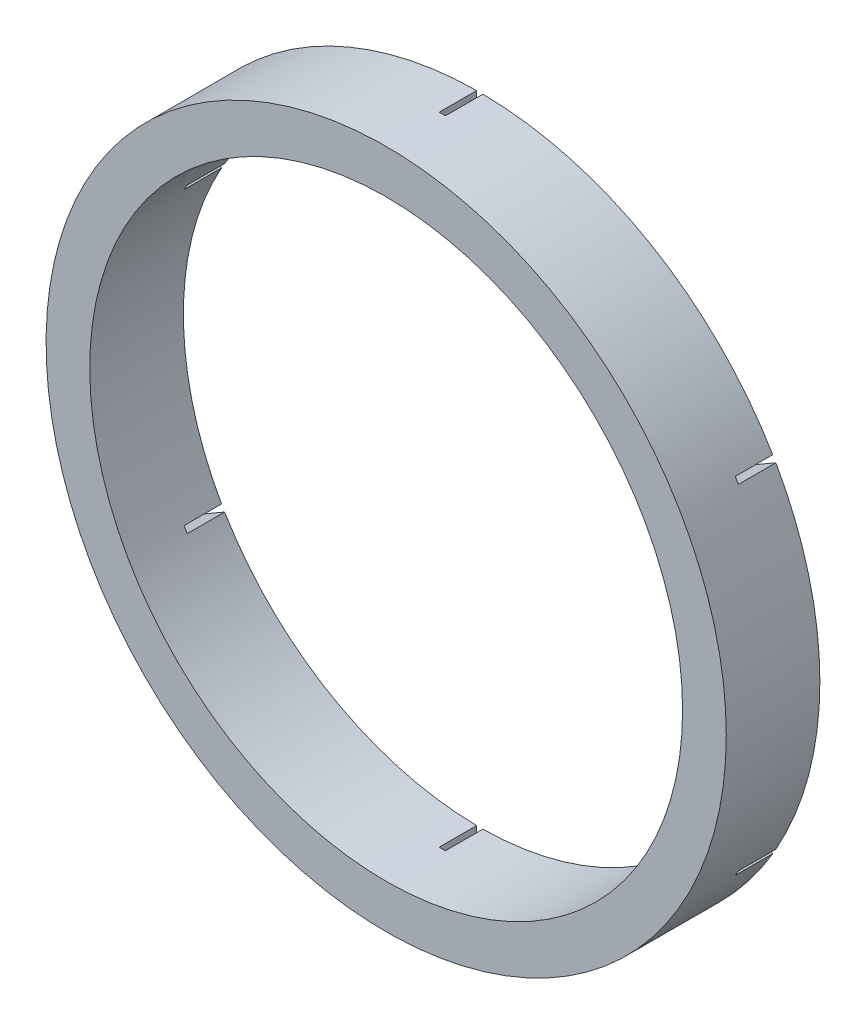
ISO-10303-21;
HEADER;
FILE_DESCRIPTION(('STEP AP214'),'2;1');
FILE_NAME('part.step','',(''),(''),'','','');
FILE_SCHEMA(('AUTOMOTIVE_DESIGN { 1 0 10303 214 1 1 1 1 }'));
ENDSEC;
DATA;
#1=APPLICATION_CONTEXT('core data for automotive mechanical design processes');
#2=APPLICATION_PROTOCOL_DEFINITION('international standard','automotive_design',2000,#1);
#3=PRODUCT_CONTEXT('',#1,'mechanical');
#4=PRODUCT('Part','Part','',(#3));
#5=PRODUCT_RELATED_PRODUCT_CATEGORY('part','',(#4));
#6=PRODUCT_DEFINITION_FORMATION('','',#4);
#7=PRODUCT_DEFINITION_CONTEXT('part definition',#1,'design');
#8=PRODUCT_DEFINITION('design','',#6,#7);
#9=PRODUCT_DEFINITION_SHAPE('','',#8);
#10=(LENGTH_UNIT() NAMED_UNIT(*) SI_UNIT(.MILLI.,.METRE.));
#11=(NAMED_UNIT(*) PLANE_ANGLE_UNIT() SI_UNIT($,.RADIAN.));
#12=(NAMED_UNIT(*) SI_UNIT($,.STERADIAN.) SOLID_ANGLE_UNIT());
#13=UNCERTAINTY_MEASURE_WITH_UNIT(LENGTH_MEASURE(1.E-05),#10,'distance_accuracy_value','');
#14=(GEOMETRIC_REPRESENTATION_CONTEXT(3) GLOBAL_UNCERTAINTY_ASSIGNED_CONTEXT((#13)) GLOBAL_UNIT_ASSIGNED_CONTEXT((#10,
#11,#12)) REPRESENTATION_CONTEXT('',''));
#15=CARTESIAN_POINT('',(0.,0.,0.));
#16=DIRECTION('',(0.,0.,1.));
#17=DIRECTION('',(1.,0.,0.));
#18=AXIS2_PLACEMENT_3D('',#15,#16,#17);
#19=CARTESIAN_POINT('',(0.,0.,0.));
#20=DIRECTION('',(0.,0.,1.));
#21=DIRECTION('',(1.,0.,0.));
#22=AXIS2_PLACEMENT_3D('',#19,#20,#21);
#23=PLANE('',#22);
#24=CARTESIAN_POINT('',(0.,0.,0.));
#25=DIRECTION('',(0.,0.,1.));
#26=DIRECTION('',(1.,0.,0.));
#27=AXIS2_PLACEMENT_3D('',#24,#25,#26);
#28=CIRCLE('',#27,47.5);
#29=CARTESIAN_POINT('',(41.3839276024035,-23.3156714721885,0.));
#30=VERTEX_POINT('',#29);
#31=CARTESIAN_POINT('',(41.3839276024064,23.3156714721833,0.));
#32=VERTEX_POINT('',#31);
#33=EDGE_CURVE('E218',#30,#32,#28,.T.);
#34=ORIENTED_EDGE('',*,*,#33,.T.);
#35=DIRECTION('',(-0.866025403784438,-0.5,0.));
#36=VECTOR('',#35,1.);
#37=CARTESIAN_POINT('',(40.0941241256798,22.5710030876935,0.));
#38=LINE('',#37,#36);
#39=CARTESIAN_POINT('',(47.446398167657,26.8158404849849,0.));
#40=VERTEX_POINT('',#39);
#41=EDGE_CURVE('E209',#40,#32,#38,.T.);
#42=ORIENTED_EDGE('',*,*,#41,.F.);
#43=CARTESIAN_POINT('',(0.,0.,0.));
#44=DIRECTION('',(0.,0.,1.));
#45=DIRECTION('',(1.,0.,0.));
#46=AXIS2_PLACEMENT_3D('',#43,#44,#45);
#47=CIRCLE('',#46,54.5);
#48=CARTESIAN_POINT('',(47.4463981676541,-26.8158404849901,0.));
#49=VERTEX_POINT('',#48);
#50=EDGE_CURVE('E562',#49,#40,#47,.T.);
#51=ORIENTED_EDGE('',*,*,#50,.F.);
#52=DIRECTION('',(0.866025403784438,-0.500000000000001,0.));
#53=VECTOR('',#52,1.);
#54=CARTESIAN_POINT('',(48.9659768137011,-27.6931696253401,0.));
#55=LINE('',#54,#53);
#56=EDGE_CURVE('E561',#30,#49,#55,.T.);
#57=ORIENTED_EDGE('',*,*,#56,.F.);
#58=EDGE_LOOP('',(#34,#42,#51,#57));
#59=FACE_BOUND('',#58,.T.);
#60=ADVANCED_FACE('F32',(#59),#23,.F.);
#61=CARTESIAN_POINT('',(0.499999999991934,-47.4973683481518,0.));
#62=VERTEX_POINT('',#61);
#63=CARTESIAN_POINT('',(40.8839276024034,-24.1816968759729,0.));
#64=VERTEX_POINT('',#63);
#65=EDGE_CURVE('E223',#62,#64,#28,.T.);
#66=ORIENTED_EDGE('',*,*,#65,.T.);
#67=DIRECTION('',(-0.866025403784439,0.5,0.));
#68=VECTOR('',#67,1.);
#69=CARTESIAN_POINT('',(39.594124125677,-23.4370284914831,0.));
#70=LINE('',#69,#68);
#71=CARTESIAN_POINT('',(46.946398167654,-27.6818658887744,0.));
#72=VERTEX_POINT('',#71);
#73=EDGE_CURVE('E255',#72,#64,#70,.T.);
#74=ORIENTED_EDGE('',*,*,#73,.F.);
#75=CARTESIAN_POINT('',(0.49999999999193,-54.4977063737549,0.));
#76=VERTEX_POINT('',#75);
#77=EDGE_CURVE('E658',#76,#72,#47,.T.);
#78=ORIENTED_EDGE('',*,*,#77,.F.);
#79=DIRECTION('',(0.,-1.,0.));
#80=VECTOR('',#79,1.);
#81=CARTESIAN_POINT('',(0.499999999991929,-56.2523646544596,0.));
#82=LINE('',#81,#80);
#83=EDGE_CURVE('E257',#62,#76,#82,.T.);
#84=ORIENTED_EDGE('',*,*,#83,.F.);
#85=EDGE_LOOP('',(#66,#74,#78,#84));
#86=FACE_BOUND('',#85,.T.);
#87=ADVANCED_FACE('F253',(#86),#23,.F.);
#88=CARTESIAN_POINT('',(-40.883927602409,-24.1816968759634,0.));
#89=VERTEX_POINT('',#88);
#90=CARTESIAN_POINT('',(-0.500000000008082,-47.4973683481516,0.));
#91=VERTEX_POINT('',#90);
#92=EDGE_CURVE('E238',#89,#91,#28,.T.);
#93=ORIENTED_EDGE('',*,*,#92,.T.);
#94=DIRECTION('',(0.,1.,0.));
#95=VECTOR('',#94,1.);
#96=CARTESIAN_POINT('',(-0.500000000008083,-46.0080315791767,0.));
#97=LINE('',#96,#95);
#98=CARTESIAN_POINT('',(-0.500000000008077,-54.4977063737548,0.));
#99=VERTEX_POINT('',#98);
#100=EDGE_CURVE('E584',#99,#91,#97,.T.);
#101=ORIENTED_EDGE('',*,*,#100,.F.);
#102=CARTESIAN_POINT('',(-46.9463981676595,-27.681865888765,0.));
#103=VERTEX_POINT('',#102);
#104=EDGE_CURVE('E656',#103,#99,#47,.T.);
#105=ORIENTED_EDGE('',*,*,#104,.F.);
#106=DIRECTION('',(-0.866025403784439,-0.499999999999999,0.));
#107=VECTOR('',#106,1.);
#108=CARTESIAN_POINT('',(-48.4659768137144,-28.5591950291196,0.));
#109=LINE('',#108,#107);
#110=EDGE_CURVE('E597',#89,#103,#109,.T.);
#111=ORIENTED_EDGE('',*,*,#110,.F.);
#112=EDGE_LOOP('',(#93,#101,#105,#111));
#113=FACE_BOUND('',#112,.T.);
#114=ADVANCED_FACE('F323',(#113),#23,.F.);
#115=CARTESIAN_POINT('',(-41.3839276024062,23.3156714721837,0.));
#116=VERTEX_POINT('',#115);
#117=CARTESIAN_POINT('',(-41.3839276024089,-23.3156714721789,0.));
#118=VERTEX_POINT('',#117);
#119=EDGE_CURVE('E231',#116,#118,#28,.T.);
#120=ORIENTED_EDGE('',*,*,#119,.T.);
#121=DIRECTION('',(0.866025403784439,0.5,0.));
#122=VECTOR('',#121,1.);
#123=CARTESIAN_POINT('',(-40.0941241256903,-22.5710030876937,0.));
#124=LINE('',#123,#122);
#125=CARTESIAN_POINT('',(-47.4463981676595,-26.8158404849805,0.));
#126=VERTEX_POINT('',#125);
#127=EDGE_CURVE('E602',#126,#118,#124,.T.);
#128=ORIENTED_EDGE('',*,*,#127,.F.);
#129=CARTESIAN_POINT('',(-47.4463981676568,26.8158404849853,0.));
#130=VERTEX_POINT('',#129);
#131=EDGE_CURVE('E301',#130,#126,#47,.T.);
#132=ORIENTED_EDGE('',*,*,#131,.F.);
#133=DIRECTION('',(-0.866025403784438,0.500000000000001,0.));
#134=VECTOR('',#133,1.);
#135=CARTESIAN_POINT('',(-48.9659768137116,27.6931696253399,0.));
#136=LINE('',#135,#134);
#137=EDGE_CURVE('E615',#116,#130,#136,.T.);
#138=ORIENTED_EDGE('',*,*,#137,.F.);
#139=EDGE_LOOP('',(#120,#128,#132,#138));
#140=FACE_BOUND('',#139,.T.);
#141=ADVANCED_FACE('F486',(#140),#23,.F.);
#142=CARTESIAN_POINT('',(-0.500000000002412,47.4973683481517,0.));
#143=VERTEX_POINT('',#142);
#144=CARTESIAN_POINT('',(-40.8839276024062,24.1816968759682,0.));
#145=VERTEX_POINT('',#144);
#146=EDGE_CURVE('E221',#143,#145,#28,.T.);
#147=ORIENTED_EDGE('',*,*,#146,.T.);
#148=DIRECTION('',(0.866025403784439,-0.5,0.));
#149=VECTOR('',#148,1.);
#150=CARTESIAN_POINT('',(-39.5941241256875,23.4370284914829,0.));
#151=LINE('',#150,#149);
#152=CARTESIAN_POINT('',(-46.9463981676568,27.6818658887698,0.));
#153=VERTEX_POINT('',#152);
#154=EDGE_CURVE('E620',#153,#145,#151,.T.);
#155=ORIENTED_EDGE('',*,*,#154,.F.);
#156=CARTESIAN_POINT('',(-0.500000000002409,54.4977063737548,0.));
#157=VERTEX_POINT('',#156);
#158=EDGE_CURVE('E299',#157,#153,#47,.T.);
#159=ORIENTED_EDGE('',*,*,#158,.F.);
#160=DIRECTION('',(0.,1.,0.));
#161=VECTOR('',#160,1.);
#162=CARTESIAN_POINT('',(-0.500000000002408,56.2523646544594,0.));
#163=LINE('',#162,#161);
#164=EDGE_CURVE('E637',#143,#157,#163,.T.);
#165=ORIENTED_EDGE('',*,*,#164,.F.);
#166=EDGE_LOOP('',(#147,#155,#159,#165));
#167=FACE_BOUND('',#166,.T.);
#168=ADVANCED_FACE('F316',(#167),#23,.F.);
#169=CARTESIAN_POINT('',(0.,0.,15.));
#170=DIRECTION('',(0.,0.,1.));
#171=DIRECTION('',(1.,0.,0.));
#172=AXIS2_PLACEMENT_3D('',#169,#170,#171);
#173=PLANE('',#172);
#174=CARTESIAN_POINT('',(0.,0.,15.));
#175=DIRECTION('',(0.,0.,1.));
#176=DIRECTION('',(1.,0.,0.));
#177=AXIS2_PLACEMENT_3D('',#174,#175,#176);
#178=CIRCLE('',#177,54.5);
#179=CARTESIAN_POINT('',(54.5,0.,15.));
#180=VERTEX_POINT('',#179);
#181=EDGE_CURVE('E298',#180,#180,#178,.T.);
#182=ORIENTED_EDGE('',*,*,#181,.T.);
#183=EDGE_LOOP('',(#182));
#184=FACE_BOUND('',#183,.T.);
#185=CARTESIAN_POINT('',(0.,0.,15.));
#186=DIRECTION('',(0.,0.,1.));
#187=DIRECTION('',(1.,0.,0.));
#188=AXIS2_PLACEMENT_3D('',#185,#186,#187);
#189=CIRCLE('',#188,47.5);
#190=CARTESIAN_POINT('',(47.5,0.,15.));
#191=VERTEX_POINT('',#190);
#192=EDGE_CURVE('E230',#191,#191,#189,.T.);
#193=ORIENTED_EDGE('',*,*,#192,.F.);
#194=EDGE_LOOP('',(#193));
#195=FACE_BOUND('',#194,.T.);
#196=ADVANCED_FACE('F305',(#184,#195),#173,.T.);
#197=CARTESIAN_POINT('',(46.946398167657,27.6818658887693,0.));
#198=VERTEX_POINT('',#197);
#199=CARTESIAN_POINT('',(0.499999999997597,54.4977063737549,0.));
#200=VERTEX_POINT('',#199);
#201=EDGE_CURVE('E208',#198,#200,#47,.T.);
#202=ORIENTED_EDGE('',*,*,#201,.F.);
#203=DIRECTION('',(0.866025403784439,0.5,0.));
#204=VECTOR('',#203,1.);
#205=CARTESIAN_POINT('',(48.465976813704,28.5591950291194,0.));
#206=LINE('',#205,#204);
#207=CARTESIAN_POINT('',(40.8839276024065,24.1816968759678,0.));
#208=VERTEX_POINT('',#207);
#209=EDGE_CURVE('E194',#208,#198,#206,.T.);
#210=ORIENTED_EDGE('',*,*,#209,.F.);
#211=CARTESIAN_POINT('',(0.499999999997603,47.4973683481517,0.));
#212=VERTEX_POINT('',#211);
#213=EDGE_CURVE('E206',#208,#212,#28,.T.);
#214=ORIENTED_EDGE('',*,*,#213,.T.);
#215=DIRECTION('',(0.,-1.,0.));
#216=VECTOR('',#215,1.);
#217=CARTESIAN_POINT('',(0.499999999997604,46.0080315791765,0.));
#218=LINE('',#217,#216);
#219=EDGE_CURVE('E633',#200,#212,#218,.T.);
#220=ORIENTED_EDGE('',*,*,#219,.F.);
#221=EDGE_LOOP('',(#202,#210,#214,#220));
#222=FACE_BOUND('',#221,.T.);
#223=ADVANCED_FACE('F204',(#222),#23,.F.);
#224=CARTESIAN_POINT('',(0.,0.,15.));
#225=DIRECTION('',(0.,0.,-1.));
#226=DIRECTION('',(-1.,0.,0.));
#227=AXIS2_PLACEMENT_3D('',#224,#225,#226);
#228=CYLINDRICAL_SURFACE('',#227,54.5);
#229=ORIENTED_EDGE('',*,*,#50,.T.);
#230=DIRECTION('',(0.,0.,-1.));
#231=VECTOR('',#230,1.);
#232=CARTESIAN_POINT('',(47.446398167657,26.8158404849849,15.));
#233=LINE('',#232,#231);
#234=CARTESIAN_POINT('',(47.446398167657,26.8158404849849,6.));
#235=VERTEX_POINT('',#234);
#236=EDGE_CURVE('E556',#40,#235,#233,.F.);
#237=ORIENTED_EDGE('',*,*,#236,.T.);
#238=CARTESIAN_POINT('',(0.,0.,6.));
#239=DIRECTION('',(0.,0.,1.));
#240=DIRECTION('',(1.,0.,0.));
#241=AXIS2_PLACEMENT_3D('',#238,#239,#240);
#242=CIRCLE('',#241,54.5);
#243=CARTESIAN_POINT('',(46.946398167657,27.6818658887693,6.));
#244=VERTEX_POINT('',#243);
#245=EDGE_CURVE('E663',#235,#244,#242,.T.);
#246=ORIENTED_EDGE('',*,*,#245,.T.);
#247=DIRECTION('',(0.,0.,-1.));
#248=VECTOR('',#247,1.);
#249=CARTESIAN_POINT('',(46.946398167657,27.6818658887693,15.));
#250=LINE('',#249,#248);
#251=EDGE_CURVE('E567',#244,#198,#250,.T.);
#252=ORIENTED_EDGE('',*,*,#251,.T.);
#253=ORIENTED_EDGE('',*,*,#201,.T.);
#254=DIRECTION('',(0.,0.,-1.));
#255=VECTOR('',#254,1.);
#256=CARTESIAN_POINT('',(0.499999999997597,54.4977063737549,15.));
#257=LINE('',#256,#255);
#258=CARTESIAN_POINT('',(0.499999999997597,54.4977063737549,6.));
#259=VERTEX_POINT('',#258);
#260=EDGE_CURVE('E219',#200,#259,#257,.F.);
#261=ORIENTED_EDGE('',*,*,#260,.T.);
#262=CARTESIAN_POINT('',(0.,0.,6.));
#263=DIRECTION('',(0.,0.,1.));
#264=DIRECTION('',(1.,0.,0.));
#265=AXIS2_PLACEMENT_3D('',#262,#263,#264);
#266=CIRCLE('',#265,54.5);
#267=CARTESIAN_POINT('',(-0.500000000002409,54.4977063737548,6.));
#268=VERTEX_POINT('',#267);
#269=EDGE_CURVE('E640',#259,#268,#266,.T.);
#270=ORIENTED_EDGE('',*,*,#269,.T.);
#271=DIRECTION('',(0.,0.,-1.));
#272=VECTOR('',#271,1.);
#273=CARTESIAN_POINT('',(-0.500000000002409,54.4977063737548,15.));
#274=LINE('',#273,#272);
#275=EDGE_CURVE('E225',#268,#157,#274,.T.);
#276=ORIENTED_EDGE('',*,*,#275,.T.);
#277=ORIENTED_EDGE('',*,*,#158,.T.);
#278=DIRECTION('',(0.,0.,-1.));
#279=VECTOR('',#278,1.);
#280=CARTESIAN_POINT('',(-46.9463981676568,27.6818658887697,15.));
#281=LINE('',#280,#279);
#282=CARTESIAN_POINT('',(-46.9463981676568,27.6818658887698,6.));
#283=VERTEX_POINT('',#282);
#284=EDGE_CURVE('E630',#153,#283,#281,.F.);
#285=ORIENTED_EDGE('',*,*,#284,.T.);
#286=CARTESIAN_POINT('',(0.,0.,6.));
#287=DIRECTION('',(0.,0.,1.));
#288=DIRECTION('',(1.,0.,0.));
#289=AXIS2_PLACEMENT_3D('',#286,#287,#288);
#290=CIRCLE('',#289,54.5);
#291=CARTESIAN_POINT('',(-47.4463981676568,26.8158404849853,6.));
#292=VERTEX_POINT('',#291);
#293=EDGE_CURVE('E622',#283,#292,#290,.T.);
#294=ORIENTED_EDGE('',*,*,#293,.T.);
#295=DIRECTION('',(0.,0.,-1.));
#296=VECTOR('',#295,1.);
#297=CARTESIAN_POINT('',(-47.4463981676568,26.8158404849853,15.));
#298=LINE('',#297,#296);
#299=EDGE_CURVE('E627',#292,#130,#298,.T.);
#300=ORIENTED_EDGE('',*,*,#299,.T.);
#301=ORIENTED_EDGE('',*,*,#131,.T.);
#302=DIRECTION('',(0.,0.,-1.));
#303=VECTOR('',#302,1.);
#304=CARTESIAN_POINT('',(-47.4463981676595,-26.8158404849805,15.));
#305=LINE('',#304,#303);
#306=CARTESIAN_POINT('',(-47.4463981676595,-26.8158404849805,6.));
#307=VERTEX_POINT('',#306);
#308=EDGE_CURVE('E612',#126,#307,#305,.F.);
#309=ORIENTED_EDGE('',*,*,#308,.T.);
#310=CARTESIAN_POINT('',(0.,0.,6.));
#311=DIRECTION('',(0.,0.,1.));
#312=DIRECTION('',(1.,0.,0.));
#313=AXIS2_PLACEMENT_3D('',#310,#311,#312);
#314=CIRCLE('',#313,54.5);
#315=CARTESIAN_POINT('',(-46.9463981676595,-27.681865888765,6.));
#316=VERTEX_POINT('',#315);
#317=EDGE_CURVE('E604',#307,#316,#314,.T.);
#318=ORIENTED_EDGE('',*,*,#317,.T.);
#319=DIRECTION('',(0.,0.,-1.));
#320=VECTOR('',#319,1.);
#321=CARTESIAN_POINT('',(-46.9463981676595,-27.681865888765,15.));
#322=LINE('',#321,#320);
#323=EDGE_CURVE('E609',#316,#103,#322,.T.);
#324=ORIENTED_EDGE('',*,*,#323,.T.);
#325=ORIENTED_EDGE('',*,*,#104,.T.);
#326=DIRECTION('',(0.,0.,-1.));
#327=VECTOR('',#326,1.);
#328=CARTESIAN_POINT('',(-0.500000000008077,-54.4977063737548,15.));
#329=LINE('',#328,#327);
#330=CARTESIAN_POINT('',(-0.500000000008077,-54.4977063737548,6.));
#331=VERTEX_POINT('',#330);
#332=EDGE_CURVE('E594',#99,#331,#329,.F.);
#333=ORIENTED_EDGE('',*,*,#332,.T.);
#334=CARTESIAN_POINT('',(0.,0.,6.));
#335=DIRECTION('',(0.,0.,1.));
#336=DIRECTION('',(1.,0.,0.));
#337=AXIS2_PLACEMENT_3D('',#334,#335,#336);
#338=CIRCLE('',#337,54.5);
#339=CARTESIAN_POINT('',(0.49999999999193,-54.4977063737549,6.));
#340=VERTEX_POINT('',#339);
#341=EDGE_CURVE('E586',#331,#340,#338,.T.);
#342=ORIENTED_EDGE('',*,*,#341,.T.);
#343=DIRECTION('',(0.,0.,-1.));
#344=VECTOR('',#343,1.);
#345=CARTESIAN_POINT('',(0.49999999999193,-54.4977063737549,15.));
#346=LINE('',#345,#344);
#347=EDGE_CURVE('E591',#340,#76,#346,.T.);
#348=ORIENTED_EDGE('',*,*,#347,.T.);
#349=ORIENTED_EDGE('',*,*,#77,.T.);
#350=DIRECTION('',(0.,0.,-1.));
#351=VECTOR('',#350,1.);
#352=CARTESIAN_POINT('',(46.946398167654,-27.6818658887744,15.));
#353=LINE('',#352,#351);
#354=CARTESIAN_POINT('',(46.946398167654,-27.6818658887744,6.));
#355=VERTEX_POINT('',#354);
#356=EDGE_CURVE('E577',#72,#355,#353,.F.);
#357=ORIENTED_EDGE('',*,*,#356,.T.);
#358=CARTESIAN_POINT('',(0.,0.,6.));
#359=DIRECTION('',(0.,0.,1.));
#360=DIRECTION('',(1.,0.,0.));
#361=AXIS2_PLACEMENT_3D('',#358,#359,#360);
#362=CIRCLE('',#361,54.5);
#363=CARTESIAN_POINT('',(47.4463981676541,-26.8158404849901,6.));
#364=VERTEX_POINT('',#363);
#365=EDGE_CURVE('E572',#355,#364,#362,.T.);
#366=ORIENTED_EDGE('',*,*,#365,.T.);
#367=DIRECTION('',(0.,0.,-1.));
#368=VECTOR('',#367,1.);
#369=CARTESIAN_POINT('',(47.4463981676541,-26.81584048499,15.));
#370=LINE('',#369,#368);
#371=EDGE_CURVE('E575',#364,#49,#370,.T.);
#372=ORIENTED_EDGE('',*,*,#371,.T.);
#373=EDGE_LOOP('',(#229,#237,#246,#252,#253,#261,#270,#276,#277,#285,#294,#300,#301,#309,#318,
#324,#325,#333,#342,#348,#349,#357,#366,#372));
#374=FACE_BOUND('',#373,.T.);
#375=ORIENTED_EDGE('',*,*,#181,.F.);
#376=EDGE_LOOP('',(#375));
#377=FACE_BOUND('',#376,.T.);
#378=ADVANCED_FACE('F34',(#374,#377),#228,.T.);
#379=CARTESIAN_POINT('',(0.,0.,15.));
#380=DIRECTION('',(0.,0.,-1.));
#381=DIRECTION('',(-1.,0.,0.));
#382=AXIS2_PLACEMENT_3D('',#379,#380,#381);
#383=CYLINDRICAL_SURFACE('',#382,47.5);
#384=DIRECTION('',(0.,0.,-1.));
#385=VECTOR('',#384,1.);
#386=CARTESIAN_POINT('',(41.3839276024065,23.3156714721833,15.));
#387=LINE('',#386,#385);
#388=CARTESIAN_POINT('',(41.3839276024064,23.3156714721833,6.));
#389=VERTEX_POINT('',#388);
#390=EDGE_CURVE('E11',#32,#389,#387,.F.);
#391=ORIENTED_EDGE('',*,*,#390,.F.);
#392=ORIENTED_EDGE('',*,*,#33,.F.);
#393=DIRECTION('',(0.,0.,-1.));
#394=VECTOR('',#393,1.);
#395=CARTESIAN_POINT('',(41.3839276024035,-23.3156714721885,15.));
#396=LINE('',#395,#394);
#397=CARTESIAN_POINT('',(41.3839276024035,-23.3156714721885,6.));
#398=VERTEX_POINT('',#397);
#399=EDGE_CURVE('E267',#398,#30,#396,.T.);
#400=ORIENTED_EDGE('',*,*,#399,.F.);
#401=CARTESIAN_POINT('',(0.,0.,6.));
#402=DIRECTION('',(0.,0.,1.));
#403=DIRECTION('',(1.,0.,0.));
#404=AXIS2_PLACEMENT_3D('',#401,#402,#403);
#405=CIRCLE('',#404,47.5);
#406=CARTESIAN_POINT('',(40.8839276024034,-24.1816968759729,6.));
#407=VERTEX_POINT('',#406);
#408=EDGE_CURVE('E265',#407,#398,#405,.T.);
#409=ORIENTED_EDGE('',*,*,#408,.F.);
#410=DIRECTION('',(0.,0.,-1.));
#411=VECTOR('',#410,1.);
#412=CARTESIAN_POINT('',(40.8839276024034,-24.1816968759729,15.));
#413=LINE('',#412,#411);
#414=EDGE_CURVE('E263',#64,#407,#413,.F.);
#415=ORIENTED_EDGE('',*,*,#414,.F.);
#416=ORIENTED_EDGE('',*,*,#65,.F.);
#417=DIRECTION('',(0.,0.,-1.));
#418=VECTOR('',#417,1.);
#419=CARTESIAN_POINT('',(0.499999999991934,-47.4973683481518,15.));
#420=LINE('',#419,#418);
#421=CARTESIAN_POINT('',(0.499999999991934,-47.4973683481518,6.));
#422=VERTEX_POINT('',#421);
#423=EDGE_CURVE('E261',#422,#62,#420,.T.);
#424=ORIENTED_EDGE('',*,*,#423,.F.);
#425=CARTESIAN_POINT('',(0.,0.,6.));
#426=DIRECTION('',(0.,0.,1.));
#427=DIRECTION('',(1.,0.,0.));
#428=AXIS2_PLACEMENT_3D('',#425,#426,#427);
#429=CIRCLE('',#428,47.5);
#430=CARTESIAN_POINT('',(-0.500000000008082,-47.4973683481516,6.));
#431=VERTEX_POINT('',#430);
#432=EDGE_CURVE('E277',#431,#422,#429,.T.);
#433=ORIENTED_EDGE('',*,*,#432,.F.);
#434=DIRECTION('',(0.,0.,-1.));
#435=VECTOR('',#434,1.);
#436=CARTESIAN_POINT('',(-0.500000000008082,-47.4973683481516,15.));
#437=LINE('',#436,#435);
#438=EDGE_CURVE('E273',#91,#431,#437,.F.);
#439=ORIENTED_EDGE('',*,*,#438,.F.);
#440=ORIENTED_EDGE('',*,*,#92,.F.);
#441=DIRECTION('',(0.,0.,-1.));
#442=VECTOR('',#441,1.);
#443=CARTESIAN_POINT('',(-40.883927602409,-24.1816968759634,15.));
#444=LINE('',#443,#442);
#445=CARTESIAN_POINT('',(-40.883927602409,-24.1816968759634,6.));
#446=VERTEX_POINT('',#445);
#447=EDGE_CURVE('E282',#446,#89,#444,.T.);
#448=ORIENTED_EDGE('',*,*,#447,.F.);
#449=CARTESIAN_POINT('',(0.,0.,6.));
#450=DIRECTION('',(0.,0.,1.));
#451=DIRECTION('',(1.,0.,0.));
#452=AXIS2_PLACEMENT_3D('',#449,#450,#451);
#453=CIRCLE('',#452,47.5);
#454=CARTESIAN_POINT('',(-41.3839276024089,-23.3156714721789,6.));
#455=VERTEX_POINT('',#454);
#456=EDGE_CURVE('E284',#455,#446,#453,.T.);
#457=ORIENTED_EDGE('',*,*,#456,.F.);
#458=DIRECTION('',(0.,0.,-1.));
#459=VECTOR('',#458,1.);
#460=CARTESIAN_POINT('',(-41.3839276024089,-23.3156714721789,15.));
#461=LINE('',#460,#459);
#462=EDGE_CURVE('E279',#118,#455,#461,.F.);
#463=ORIENTED_EDGE('',*,*,#462,.F.);
#464=ORIENTED_EDGE('',*,*,#119,.F.);
#465=DIRECTION('',(0.,0.,-1.));
#466=VECTOR('',#465,1.);
#467=CARTESIAN_POINT('',(-41.3839276024062,23.3156714721837,15.));
#468=LINE('',#467,#466);
#469=CARTESIAN_POINT('',(-41.3839276024062,23.3156714721837,6.));
#470=VERTEX_POINT('',#469);
#471=EDGE_CURVE('E289',#470,#116,#468,.T.);
#472=ORIENTED_EDGE('',*,*,#471,.F.);
#473=CARTESIAN_POINT('',(0.,0.,6.));
#474=DIRECTION('',(0.,0.,1.));
#475=DIRECTION('',(1.,0.,0.));
#476=AXIS2_PLACEMENT_3D('',#473,#474,#475);
#477=CIRCLE('',#476,47.5);
#478=CARTESIAN_POINT('',(-40.8839276024062,24.1816968759682,6.));
#479=VERTEX_POINT('',#478);
#480=EDGE_CURVE('E291',#479,#470,#477,.T.);
#481=ORIENTED_EDGE('',*,*,#480,.F.);
#482=DIRECTION('',(0.,0.,-1.));
#483=VECTOR('',#482,1.);
#484=CARTESIAN_POINT('',(-40.8839276024062,24.1816968759682,15.));
#485=LINE('',#484,#483);
#486=EDGE_CURVE('E286',#145,#479,#485,.F.);
#487=ORIENTED_EDGE('',*,*,#486,.F.);
#488=ORIENTED_EDGE('',*,*,#146,.F.);
#489=DIRECTION('',(0.,0.,-1.));
#490=VECTOR('',#489,1.);
#491=CARTESIAN_POINT('',(-0.500000000002412,47.4973683481517,15.));
#492=LINE('',#491,#490);
#493=CARTESIAN_POINT('',(-0.500000000002412,47.4973683481517,6.));
#494=VERTEX_POINT('',#493);
#495=EDGE_CURVE('E294',#494,#143,#492,.T.);
#496=ORIENTED_EDGE('',*,*,#495,.F.);
#497=CARTESIAN_POINT('',(0.,0.,6.));
#498=DIRECTION('',(0.,0.,1.));
#499=DIRECTION('',(1.,0.,0.));
#500=AXIS2_PLACEMENT_3D('',#497,#498,#499);
#501=CIRCLE('',#500,47.5);
#502=CARTESIAN_POINT('',(0.499999999997603,47.4973683481517,6.));
#503=VERTEX_POINT('',#502);
#504=EDGE_CURVE('E296',#503,#494,#501,.T.);
#505=ORIENTED_EDGE('',*,*,#504,.F.);
#506=DIRECTION('',(0.,0.,-1.));
#507=VECTOR('',#506,1.);
#508=CARTESIAN_POINT('',(0.499999999997603,47.4973683481517,15.));
#509=LINE('',#508,#507);
#510=EDGE_CURVE('E217',#212,#503,#509,.F.);
#511=ORIENTED_EDGE('',*,*,#510,.F.);
#512=ORIENTED_EDGE('',*,*,#213,.F.);
#513=DIRECTION('',(0.,0.,-1.));
#514=VECTOR('',#513,1.);
#515=CARTESIAN_POINT('',(40.8839276024065,24.1816968759678,15.));
#516=LINE('',#515,#514);
#517=CARTESIAN_POINT('',(40.8839276024065,24.1816968759678,6.));
#518=VERTEX_POINT('',#517);
#519=EDGE_CURVE('E40',#518,#208,#516,.T.);
#520=ORIENTED_EDGE('',*,*,#519,.F.);
#521=CARTESIAN_POINT('',(0.,0.,6.));
#522=DIRECTION('',(0.,0.,1.));
#523=DIRECTION('',(1.,0.,0.));
#524=AXIS2_PLACEMENT_3D('',#521,#522,#523);
#525=CIRCLE('',#524,47.5);
#526=EDGE_CURVE('E201',#389,#518,#525,.T.);
#527=ORIENTED_EDGE('',*,*,#526,.F.);
#528=EDGE_LOOP('',(#391,#392,#400,#409,#415,#416,#424,#433,#439,#440,#448,#457,#463,#464,#472,
#481,#487,#488,#496,#505,#511,#512,#520,#527));
#529=FACE_BOUND('',#528,.T.);
#530=ORIENTED_EDGE('',*,*,#192,.T.);
#531=EDGE_LOOP('',(#530));
#532=FACE_BOUND('',#531,.T.);
#533=ADVANCED_FACE('F213',(#529,#532),#383,.F.);
#534=CARTESIAN_POINT('',(0.499999999997604,46.0080315791765,6.));
#535=DIRECTION('',(1.,0.,0.));
#536=DIRECTION('',(0.,1.,0.));
#537=AXIS2_PLACEMENT_3D('',#534,#535,#536);
#538=PLANE('',#537);
#539=ORIENTED_EDGE('',*,*,#219,.T.);
#540=ORIENTED_EDGE('',*,*,#510,.T.);
#541=DIRECTION('',(0.,-1.,0.));
#542=VECTOR('',#541,1.);
#543=CARTESIAN_POINT('',(0.499999999997604,46.0080315791765,6.));
#544=LINE('',#543,#542);
#545=EDGE_CURVE('E634',#259,#503,#544,.T.);
#546=ORIENTED_EDGE('',*,*,#545,.F.);
#547=ORIENTED_EDGE('',*,*,#260,.F.);
#548=EDGE_LOOP('',(#539,#540,#546,#547));
#549=FACE_BOUND('',#548,.T.);
#550=ADVANCED_FACE('F314',(#549),#538,.F.);
#551=CARTESIAN_POINT('',(-0.500000000002408,56.2523646544594,6.));
#552=DIRECTION('',(-1.,0.,0.));
#553=DIRECTION('',(0.,-1.,0.));
#554=AXIS2_PLACEMENT_3D('',#551,#552,#553);
#555=PLANE('',#554);
#556=DIRECTION('',(0.,1.,0.));
#557=VECTOR('',#556,1.);
#558=CARTESIAN_POINT('',(-0.500000000002408,56.2523646544594,6.));
#559=LINE('',#558,#557);
#560=EDGE_CURVE('E636',#494,#268,#559,.T.);
#561=ORIENTED_EDGE('',*,*,#560,.F.);
#562=ORIENTED_EDGE('',*,*,#495,.T.);
#563=ORIENTED_EDGE('',*,*,#164,.T.);
#564=ORIENTED_EDGE('',*,*,#275,.F.);
#565=EDGE_LOOP('',(#561,#562,#563,#564));
#566=FACE_BOUND('',#565,.T.);
#567=ADVANCED_FACE('F329',(#566),#555,.F.);
#568=CARTESIAN_POINT('',(0.,0.,6.));
#569=DIRECTION('',(0.,0.,1.));
#570=DIRECTION('',(1.,0.,0.));
#571=AXIS2_PLACEMENT_3D('',#568,#569,#570);
#572=PLANE('',#571);
#573=ORIENTED_EDGE('',*,*,#545,.T.);
#574=ORIENTED_EDGE('',*,*,#504,.T.);
#575=ORIENTED_EDGE('',*,*,#560,.T.);
#576=ORIENTED_EDGE('',*,*,#269,.F.);
#577=EDGE_LOOP('',(#573,#574,#575,#576));
#578=FACE_BOUND('',#577,.T.);
#579=ADVANCED_FACE('F333',(#578),#572,.F.);
#580=CARTESIAN_POINT('',(-39.5941241256875,23.4370284914829,6.));
#581=DIRECTION('',(0.5,0.866025403784439,0.));
#582=DIRECTION('',(-0.866025403784439,0.5,0.));
#583=AXIS2_PLACEMENT_3D('',#580,#581,#582);
#584=PLANE('',#583);
#585=ORIENTED_EDGE('',*,*,#154,.T.);
#586=ORIENTED_EDGE('',*,*,#486,.T.);
#587=DIRECTION('',(0.866025403784439,-0.5,0.));
#588=VECTOR('',#587,1.);
#589=CARTESIAN_POINT('',(-39.5941241256875,23.4370284914829,6.));
#590=LINE('',#589,#588);
#591=EDGE_CURVE('E619',#283,#479,#590,.T.);
#592=ORIENTED_EDGE('',*,*,#591,.F.);
#593=ORIENTED_EDGE('',*,*,#284,.F.);
#594=EDGE_LOOP('',(#585,#586,#592,#593));
#595=FACE_BOUND('',#594,.T.);
#596=ADVANCED_FACE('F337',(#595),#584,.F.);
#597=CARTESIAN_POINT('',(-48.9659768137116,27.6931696253399,6.));
#598=DIRECTION('',(-0.500000000000001,-0.866025403784438,0.));
#599=DIRECTION('',(0.866025403784438,-0.500000000000001,0.));
#600=AXIS2_PLACEMENT_3D('',#597,#598,#599);
#601=PLANE('',#600);
#602=DIRECTION('',(-0.866025403784438,0.500000000000001,0.));
#603=VECTOR('',#602,1.);
#604=CARTESIAN_POINT('',(-48.9659768137116,27.6931696253399,6.));
#605=LINE('',#604,#603);
#606=EDGE_CURVE('E616',#470,#292,#605,.T.);
#607=ORIENTED_EDGE('',*,*,#606,.F.);
#608=ORIENTED_EDGE('',*,*,#471,.T.);
#609=ORIENTED_EDGE('',*,*,#137,.T.);
#610=ORIENTED_EDGE('',*,*,#299,.F.);
#611=EDGE_LOOP('',(#607,#608,#609,#610));
#612=FACE_BOUND('',#611,.T.);
#613=ADVANCED_FACE('F339',(#612),#601,.F.);
#614=CARTESIAN_POINT('',(0.,0.,6.));
#615=DIRECTION('',(0.,0.,1.));
#616=DIRECTION('',(1.,0.,0.));
#617=AXIS2_PLACEMENT_3D('',#614,#615,#616);
#618=PLANE('',#617);
#619=ORIENTED_EDGE('',*,*,#591,.T.);
#620=ORIENTED_EDGE('',*,*,#480,.T.);
#621=ORIENTED_EDGE('',*,*,#606,.T.);
#622=ORIENTED_EDGE('',*,*,#293,.F.);
#623=EDGE_LOOP('',(#619,#620,#621,#622));
#624=FACE_BOUND('',#623,.T.);
#625=ADVANCED_FACE('F342',(#624),#618,.F.);
#626=CARTESIAN_POINT('',(-40.0941241256903,-22.5710030876937,6.));
#627=DIRECTION('',(-0.5,0.866025403784439,0.));
#628=DIRECTION('',(-0.866025403784439,-0.5,0.));
#629=AXIS2_PLACEMENT_3D('',#626,#627,#628);
#630=PLANE('',#629);
#631=ORIENTED_EDGE('',*,*,#127,.T.);
#632=ORIENTED_EDGE('',*,*,#462,.T.);
#633=DIRECTION('',(0.866025403784439,0.5,0.));
#634=VECTOR('',#633,1.);
#635=CARTESIAN_POINT('',(-40.0941241256903,-22.5710030876937,6.));
#636=LINE('',#635,#634);
#637=EDGE_CURVE('E601',#307,#455,#636,.T.);
#638=ORIENTED_EDGE('',*,*,#637,.F.);
#639=ORIENTED_EDGE('',*,*,#308,.F.);
#640=EDGE_LOOP('',(#631,#632,#638,#639));
#641=FACE_BOUND('',#640,.T.);
#642=ADVANCED_FACE('F349',(#641),#630,.F.);
#643=CARTESIAN_POINT('',(-48.4659768137144,-28.5591950291196,6.));
#644=DIRECTION('',(0.499999999999999,-0.866025403784439,0.));
#645=DIRECTION('',(0.866025403784439,0.499999999999999,0.));
#646=AXIS2_PLACEMENT_3D('',#643,#644,#645);
#647=PLANE('',#646);
#648=DIRECTION('',(-0.866025403784439,-0.499999999999999,0.));
#649=VECTOR('',#648,1.);
#650=CARTESIAN_POINT('',(-48.4659768137144,-28.5591950291196,6.));
#651=LINE('',#650,#649);
#652=EDGE_CURVE('E598',#446,#316,#651,.T.);
#653=ORIENTED_EDGE('',*,*,#652,.F.);
#654=ORIENTED_EDGE('',*,*,#447,.T.);
#655=ORIENTED_EDGE('',*,*,#110,.T.);
#656=ORIENTED_EDGE('',*,*,#323,.F.);
#657=EDGE_LOOP('',(#653,#654,#655,#656));
#658=FACE_BOUND('',#657,.T.);
#659=ADVANCED_FACE('F351',(#658),#647,.F.);
#660=CARTESIAN_POINT('',(0.,0.,6.));
#661=DIRECTION('',(0.,0.,1.));
#662=DIRECTION('',(1.,0.,0.));
#663=AXIS2_PLACEMENT_3D('',#660,#661,#662);
#664=PLANE('',#663);
#665=ORIENTED_EDGE('',*,*,#637,.T.);
#666=ORIENTED_EDGE('',*,*,#456,.T.);
#667=ORIENTED_EDGE('',*,*,#652,.T.);
#668=ORIENTED_EDGE('',*,*,#317,.F.);
#669=EDGE_LOOP('',(#665,#666,#667,#668));
#670=FACE_BOUND('',#669,.T.);
#671=ADVANCED_FACE('F354',(#670),#664,.F.);
#672=CARTESIAN_POINT('',(-0.500000000008083,-46.0080315791767,6.));
#673=DIRECTION('',(-1.,0.,0.));
#674=DIRECTION('',(0.,-1.,0.));
#675=AXIS2_PLACEMENT_3D('',#672,#673,#674);
#676=PLANE('',#675);
#677=ORIENTED_EDGE('',*,*,#100,.T.);
#678=ORIENTED_EDGE('',*,*,#438,.T.);
#679=DIRECTION('',(0.,1.,0.));
#680=VECTOR('',#679,1.);
#681=CARTESIAN_POINT('',(-0.500000000008083,-46.0080315791767,6.));
#682=LINE('',#681,#680);
#683=EDGE_CURVE('E583',#331,#431,#682,.T.);
#684=ORIENTED_EDGE('',*,*,#683,.F.);
#685=ORIENTED_EDGE('',*,*,#332,.F.);
#686=EDGE_LOOP('',(#677,#678,#684,#685));
#687=FACE_BOUND('',#686,.T.);
#688=ADVANCED_FACE('F361',(#687),#676,.F.);
#689=CARTESIAN_POINT('',(0.499999999991929,-56.2523646544596,6.));
#690=DIRECTION('',(1.,0.,0.));
#691=DIRECTION('',(0.,1.,0.));
#692=AXIS2_PLACEMENT_3D('',#689,#690,#691);
#693=PLANE('',#692);
#694=DIRECTION('',(0.,-1.,0.));
#695=VECTOR('',#694,1.);
#696=CARTESIAN_POINT('',(0.499999999991929,-56.2523646544596,6.));
#697=LINE('',#696,#695);
#698=EDGE_CURVE('E580',#422,#340,#697,.T.);
#699=ORIENTED_EDGE('',*,*,#698,.F.);
#700=ORIENTED_EDGE('',*,*,#423,.T.);
#701=ORIENTED_EDGE('',*,*,#83,.T.);
#702=ORIENTED_EDGE('',*,*,#347,.F.);
#703=EDGE_LOOP('',(#699,#700,#701,#702));
#704=FACE_BOUND('',#703,.T.);
#705=ADVANCED_FACE('F363',(#704),#693,.F.);
#706=CARTESIAN_POINT('',(0.,0.,6.));
#707=DIRECTION('',(0.,0.,1.));
#708=DIRECTION('',(1.,0.,0.));
#709=AXIS2_PLACEMENT_3D('',#706,#707,#708);
#710=PLANE('',#709);
#711=ORIENTED_EDGE('',*,*,#683,.T.);
#712=ORIENTED_EDGE('',*,*,#432,.T.);
#713=ORIENTED_EDGE('',*,*,#698,.T.);
#714=ORIENTED_EDGE('',*,*,#341,.F.);
#715=EDGE_LOOP('',(#711,#712,#713,#714));
#716=FACE_BOUND('',#715,.T.);
#717=ADVANCED_FACE('F366',(#716),#710,.F.);
#718=CARTESIAN_POINT('',(39.594124125677,-23.4370284914831,6.));
#719=DIRECTION('',(-0.5,-0.866025403784439,0.));
#720=DIRECTION('',(0.866025403784439,-0.5,0.));
#721=AXIS2_PLACEMENT_3D('',#718,#719,#720);
#722=PLANE('',#721);
#723=ORIENTED_EDGE('',*,*,#73,.T.);
#724=ORIENTED_EDGE('',*,*,#414,.T.);
#725=DIRECTION('',(-0.866025403784439,0.5,0.));
#726=VECTOR('',#725,1.);
#727=CARTESIAN_POINT('',(39.594124125677,-23.4370284914831,6.));
#728=LINE('',#727,#726);
#729=EDGE_CURVE('E54',#355,#407,#728,.T.);
#730=ORIENTED_EDGE('',*,*,#729,.F.);
#731=ORIENTED_EDGE('',*,*,#356,.F.);
#732=EDGE_LOOP('',(#723,#724,#730,#731));
#733=FACE_BOUND('',#732,.T.);
#734=ADVANCED_FACE('F373',(#733),#722,.F.);
#735=CARTESIAN_POINT('',(48.9659768137011,-27.6931696253401,6.));
#736=DIRECTION('',(0.500000000000001,0.866025403784438,0.));
#737=DIRECTION('',(-0.866025403784438,0.500000000000001,0.));
#738=AXIS2_PLACEMENT_3D('',#735,#736,#737);
#739=PLANE('',#738);
#740=DIRECTION('',(0.866025403784438,-0.500000000000001,0.));
#741=VECTOR('',#740,1.);
#742=CARTESIAN_POINT('',(48.9659768137011,-27.6931696253401,6.));
#743=LINE('',#742,#741);
#744=EDGE_CURVE('E565',#398,#364,#743,.T.);
#745=ORIENTED_EDGE('',*,*,#744,.F.);
#746=ORIENTED_EDGE('',*,*,#399,.T.);
#747=ORIENTED_EDGE('',*,*,#56,.T.);
#748=ORIENTED_EDGE('',*,*,#371,.F.);
#749=EDGE_LOOP('',(#745,#746,#747,#748));
#750=FACE_BOUND('',#749,.T.);
#751=ADVANCED_FACE('F375',(#750),#739,.F.);
#752=CARTESIAN_POINT('',(0.,0.,6.));
#753=DIRECTION('',(0.,0.,1.));
#754=DIRECTION('',(1.,0.,0.));
#755=AXIS2_PLACEMENT_3D('',#752,#753,#754);
#756=PLANE('',#755);
#757=ORIENTED_EDGE('',*,*,#729,.T.);
#758=ORIENTED_EDGE('',*,*,#408,.T.);
#759=ORIENTED_EDGE('',*,*,#744,.T.);
#760=ORIENTED_EDGE('',*,*,#365,.F.);
#761=EDGE_LOOP('',(#757,#758,#759,#760));
#762=FACE_BOUND('',#761,.T.);
#763=ADVANCED_FACE('F378',(#762),#756,.F.);
#764=CARTESIAN_POINT('',(40.0941241256798,22.5710030876935,6.));
#765=DIRECTION('',(0.5,-0.866025403784439,0.));
#766=DIRECTION('',(0.866025403784439,0.5,0.));
#767=AXIS2_PLACEMENT_3D('',#764,#765,#766);
#768=PLANE('',#767);
#769=ORIENTED_EDGE('',*,*,#41,.T.);
#770=ORIENTED_EDGE('',*,*,#390,.T.);
#771=DIRECTION('',(-0.866025403784438,-0.5,0.));
#772=VECTOR('',#771,1.);
#773=CARTESIAN_POINT('',(40.0941241256798,22.5710030876935,6.));
#774=LINE('',#773,#772);
#775=EDGE_CURVE('E47',#235,#389,#774,.T.);
#776=ORIENTED_EDGE('',*,*,#775,.F.);
#777=ORIENTED_EDGE('',*,*,#236,.F.);
#778=EDGE_LOOP('',(#769,#770,#776,#777));
#779=FACE_BOUND('',#778,.T.);
#780=ADVANCED_FACE('F384',(#779),#768,.F.);
#781=CARTESIAN_POINT('',(48.465976813704,28.5591950291194,6.));
#782=DIRECTION('',(-0.5,0.866025403784439,0.));
#783=DIRECTION('',(-0.866025403784439,-0.5,0.));
#784=AXIS2_PLACEMENT_3D('',#781,#782,#783);
#785=PLANE('',#784);
#786=DIRECTION('',(0.866025403784439,0.5,0.));
#787=VECTOR('',#786,1.);
#788=CARTESIAN_POINT('',(48.465976813704,28.5591950291194,6.));
#789=LINE('',#788,#787);
#790=EDGE_CURVE('E197',#518,#244,#789,.T.);
#791=ORIENTED_EDGE('',*,*,#790,.F.);
#792=ORIENTED_EDGE('',*,*,#519,.T.);
#793=ORIENTED_EDGE('',*,*,#209,.T.);
#794=ORIENTED_EDGE('',*,*,#251,.F.);
#795=EDGE_LOOP('',(#791,#792,#793,#794));
#796=FACE_BOUND('',#795,.T.);
#797=ADVANCED_FACE('F193',(#796),#785,.F.);
#798=CARTESIAN_POINT('',(0.,0.,6.));
#799=DIRECTION('',(0.,0.,1.));
#800=DIRECTION('',(1.,0.,0.));
#801=AXIS2_PLACEMENT_3D('',#798,#799,#800);
#802=PLANE('',#801);
#803=ORIENTED_EDGE('',*,*,#775,.T.);
#804=ORIENTED_EDGE('',*,*,#526,.T.);
#805=ORIENTED_EDGE('',*,*,#790,.T.);
#806=ORIENTED_EDGE('',*,*,#245,.F.);
#807=EDGE_LOOP('',(#803,#804,#805,#806));
#808=FACE_BOUND('',#807,.T.);
#809=ADVANCED_FACE('F387',(#808),#802,.F.);
#810=CLOSED_SHELL('',(#60,#87,#114,#141,#168,#196,#223,#378,#533,#550,#567,#579,#596,#613,#625,
#642,#659,#671,#688,#705,#717,#734,#751,#763,#780,#797,#809));
#811=MANIFOLD_SOLID_BREP('B2',#810);
#812=ADVANCED_BREP_SHAPE_REPRESENTATION('',(#18,#811),#14);
#813=SHAPE_DEFINITION_REPRESENTATION(#9,#812);
ENDSEC;
END-ISO-10303-21;
